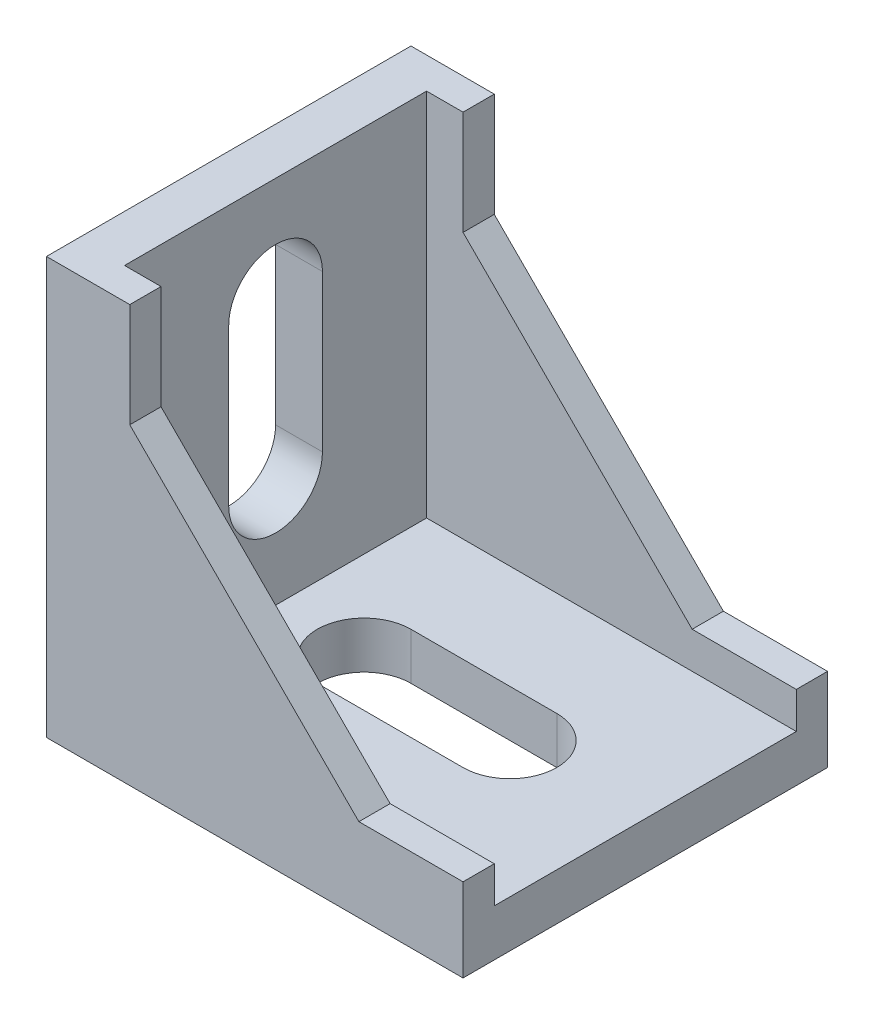
ISO-10303-21;
HEADER;
FILE_DESCRIPTION(('STEP AP214'),'2;1');
FILE_NAME('part.step','',(''),(''),'','','');
FILE_SCHEMA(('AUTOMOTIVE_DESIGN { 1 0 10303 214 1 1 1 1 }'));
ENDSEC;
DATA;
#1=APPLICATION_CONTEXT('core data for automotive mechanical design processes');
#2=APPLICATION_PROTOCOL_DEFINITION('international standard','automotive_design',2000,#1);
#3=PRODUCT_CONTEXT('',#1,'mechanical');
#4=PRODUCT('Part','Part','',(#3));
#5=PRODUCT_RELATED_PRODUCT_CATEGORY('part','',(#4));
#6=PRODUCT_DEFINITION_FORMATION('','',#4);
#7=PRODUCT_DEFINITION_CONTEXT('part definition',#1,'design');
#8=PRODUCT_DEFINITION('design','',#6,#7);
#9=PRODUCT_DEFINITION_SHAPE('','',#8);
#10=(LENGTH_UNIT() NAMED_UNIT(*) SI_UNIT(.MILLI.,.METRE.));
#11=(NAMED_UNIT(*) PLANE_ANGLE_UNIT() SI_UNIT($,.RADIAN.));
#12=(NAMED_UNIT(*) SI_UNIT($,.STERADIAN.) SOLID_ANGLE_UNIT());
#13=UNCERTAINTY_MEASURE_WITH_UNIT(LENGTH_MEASURE(1.E-05),#10,'distance_accuracy_value','');
#14=(GEOMETRIC_REPRESENTATION_CONTEXT(3) GLOBAL_UNCERTAINTY_ASSIGNED_CONTEXT((#13)) GLOBAL_UNIT_ASSIGNED_CONTEXT((#10,
#11,#12)) REPRESENTATION_CONTEXT('',''));
#15=CARTESIAN_POINT('',(0.,0.,0.));
#16=DIRECTION('',(0.,0.,1.));
#17=DIRECTION('',(1.,0.,0.));
#18=AXIS2_PLACEMENT_3D('',#15,#16,#17);
#19=CARTESIAN_POINT('',(0.,40.,-17.5));
#20=DIRECTION('',(0.,1.,0.));
#21=DIRECTION('',(0.,0.,1.));
#22=AXIS2_PLACEMENT_3D('',#19,#20,#21);
#23=PLANE('',#22);
#24=DIRECTION('',(0.,0.,1.));
#25=VECTOR('',#24,1.);
#26=CARTESIAN_POINT('',(4.5,40.,-14.5));
#27=LINE('',#26,#25);
#28=CARTESIAN_POINT('',(4.5,40.,-14.5));
#29=VERTEX_POINT('',#28);
#30=CARTESIAN_POINT('',(4.5,40.,14.5));
#31=VERTEX_POINT('',#30);
#32=EDGE_CURVE('E264',#29,#31,#27,.T.);
#33=ORIENTED_EDGE('',*,*,#32,.F.);
#34=DIRECTION('',(-1.,0.,0.));
#35=VECTOR('',#34,1.);
#36=CARTESIAN_POINT('',(8.,40.,-14.5));
#37=LINE('',#36,#35);
#38=CARTESIAN_POINT('',(8.,40.,-14.5));
#39=VERTEX_POINT('',#38);
#40=EDGE_CURVE('E252',#39,#29,#37,.T.);
#41=ORIENTED_EDGE('',*,*,#40,.F.);
#42=DIRECTION('',(0.,0.,1.));
#43=VECTOR('',#42,1.);
#44=CARTESIAN_POINT('',(8.,40.,-17.5));
#45=LINE('',#44,#43);
#46=CARTESIAN_POINT('',(8.,40.,-17.5));
#47=VERTEX_POINT('',#46);
#48=EDGE_CURVE('E11',#47,#39,#45,.T.);
#49=ORIENTED_EDGE('',*,*,#48,.F.);
#50=DIRECTION('',(-1.,0.,0.));
#51=VECTOR('',#50,1.);
#52=CARTESIAN_POINT('',(0.,40.,-17.5));
#53=LINE('',#52,#51);
#54=CARTESIAN_POINT('',(0.,40.,-17.5));
#55=VERTEX_POINT('',#54);
#56=EDGE_CURVE('E297',#47,#55,#53,.T.);
#57=ORIENTED_EDGE('',*,*,#56,.T.);
#58=DIRECTION('',(0.,0.,1.));
#59=VECTOR('',#58,1.);
#60=CARTESIAN_POINT('',(0.,40.,-17.5));
#61=LINE('',#60,#59);
#62=CARTESIAN_POINT('',(0.,40.,17.5));
#63=VERTEX_POINT('',#62);
#64=EDGE_CURVE('E37',#55,#63,#61,.T.);
#65=ORIENTED_EDGE('',*,*,#64,.T.);
#66=DIRECTION('',(-1.,0.,0.));
#67=VECTOR('',#66,1.);
#68=CARTESIAN_POINT('',(0.,40.,17.5));
#69=LINE('',#68,#67);
#70=CARTESIAN_POINT('',(8.,40.,17.5));
#71=VERTEX_POINT('',#70);
#72=EDGE_CURVE('E296',#71,#63,#69,.T.);
#73=ORIENTED_EDGE('',*,*,#72,.F.);
#74=CARTESIAN_POINT('',(8.,40.,14.5));
#75=VERTEX_POINT('',#74);
#76=EDGE_CURVE('E42',#75,#71,#45,.T.);
#77=ORIENTED_EDGE('',*,*,#76,.F.);
#78=DIRECTION('',(-1.,0.,0.));
#79=VECTOR('',#78,1.);
#80=CARTESIAN_POINT('',(8.,40.,14.5));
#81=LINE('',#80,#79);
#82=EDGE_CURVE('E251',#75,#31,#81,.T.);
#83=ORIENTED_EDGE('',*,*,#82,.T.);
#84=EDGE_LOOP('',(#33,#41,#49,#57,#65,#73,#77,#83));
#85=FACE_BOUND('',#84,.T.);
#86=ADVANCED_FACE('F34',(#85),#23,.T.);
#87=CARTESIAN_POINT('',(8.,40.,-17.5));
#88=DIRECTION('',(1.,0.,0.));
#89=DIRECTION('',(0.,1.,0.));
#90=AXIS2_PLACEMENT_3D('',#87,#88,#89);
#91=PLANE('',#90);
#92=ORIENTED_EDGE('',*,*,#48,.T.);
#93=DIRECTION('',(0.,-1.,0.));
#94=VECTOR('',#93,1.);
#95=CARTESIAN_POINT('',(8.,40.,-14.5));
#96=LINE('',#95,#94);
#97=CARTESIAN_POINT('',(8.,30.,-14.5));
#98=VERTEX_POINT('',#97);
#99=EDGE_CURVE('E293',#39,#98,#96,.T.);
#100=ORIENTED_EDGE('',*,*,#99,.T.);
#101=DIRECTION('',(0.,0.,1.));
#102=VECTOR('',#101,1.);
#103=CARTESIAN_POINT('',(8.,30.,-17.5));
#104=LINE('',#103,#102);
#105=CARTESIAN_POINT('',(8.,30.,-17.5));
#106=VERTEX_POINT('',#105);
#107=EDGE_CURVE('E338',#106,#98,#104,.T.);
#108=ORIENTED_EDGE('',*,*,#107,.F.);
#109=DIRECTION('',(0.,1.,0.));
#110=VECTOR('',#109,1.);
#111=CARTESIAN_POINT('',(8.,40.,-17.5));
#112=LINE('',#111,#110);
#113=EDGE_CURVE('E316',#106,#47,#112,.T.);
#114=ORIENTED_EDGE('',*,*,#113,.T.);
#115=EDGE_LOOP('',(#92,#100,#108,#114));
#116=FACE_BOUND('',#115,.T.);
#117=ADVANCED_FACE('F380',(#116),#91,.T.);
#118=CARTESIAN_POINT('',(8.,30.,-17.5));
#119=DIRECTION('',(0.707106781186548,0.707106781186548,0.));
#120=DIRECTION('',(-0.707106781186548,0.707106781186548,0.));
#121=AXIS2_PLACEMENT_3D('',#118,#119,#120);
#122=PLANE('',#121);
#123=ORIENTED_EDGE('',*,*,#107,.T.);
#124=DIRECTION('',(0.707106781186548,-0.707106781186548,0.));
#125=VECTOR('',#124,1.);
#126=CARTESIAN_POINT('',(8.,30.,-14.5));
#127=LINE('',#126,#125);
#128=CARTESIAN_POINT('',(30.,8.,-14.5));
#129=VERTEX_POINT('',#128);
#130=EDGE_CURVE('E290',#98,#129,#127,.T.);
#131=ORIENTED_EDGE('',*,*,#130,.T.);
#132=DIRECTION('',(0.,0.,1.));
#133=VECTOR('',#132,1.);
#134=CARTESIAN_POINT('',(30.,8.,-17.5));
#135=LINE('',#134,#133);
#136=CARTESIAN_POINT('',(30.,8.,-17.5));
#137=VERTEX_POINT('',#136);
#138=EDGE_CURVE('E342',#137,#129,#135,.T.);
#139=ORIENTED_EDGE('',*,*,#138,.F.);
#140=DIRECTION('',(-0.707106781186548,0.707106781186548,0.));
#141=VECTOR('',#140,1.);
#142=CARTESIAN_POINT('',(8.,30.,-17.5));
#143=LINE('',#142,#141);
#144=EDGE_CURVE('E313',#137,#106,#143,.T.);
#145=ORIENTED_EDGE('',*,*,#144,.T.);
#146=EDGE_LOOP('',(#123,#131,#139,#145));
#147=FACE_BOUND('',#146,.T.);
#148=ADVANCED_FACE('F407',(#147),#122,.T.);
#149=CARTESIAN_POINT('',(30.,8.,-17.5));
#150=DIRECTION('',(0.,1.,0.));
#151=DIRECTION('',(0.,0.,1.));
#152=AXIS2_PLACEMENT_3D('',#149,#150,#151);
#153=PLANE('',#152);
#154=ORIENTED_EDGE('',*,*,#138,.T.);
#155=DIRECTION('',(1.,0.,0.));
#156=VECTOR('',#155,1.);
#157=CARTESIAN_POINT('',(30.,8.,-14.5));
#158=LINE('',#157,#156);
#159=CARTESIAN_POINT('',(40.,8.,-14.5));
#160=VERTEX_POINT('',#159);
#161=EDGE_CURVE('E287',#129,#160,#158,.T.);
#162=ORIENTED_EDGE('',*,*,#161,.T.);
#163=DIRECTION('',(0.,0.,1.));
#164=VECTOR('',#163,1.);
#165=CARTESIAN_POINT('',(40.,8.,-17.5));
#166=LINE('',#165,#164);
#167=CARTESIAN_POINT('',(40.,8.,-17.5));
#168=VERTEX_POINT('',#167);
#169=EDGE_CURVE('E346',#168,#160,#166,.T.);
#170=ORIENTED_EDGE('',*,*,#169,.F.);
#171=DIRECTION('',(-1.,0.,0.));
#172=VECTOR('',#171,1.);
#173=CARTESIAN_POINT('',(30.,8.,-17.5));
#174=LINE('',#173,#172);
#175=EDGE_CURVE('E310',#168,#137,#174,.T.);
#176=ORIENTED_EDGE('',*,*,#175,.T.);
#177=EDGE_LOOP('',(#154,#162,#170,#176));
#178=FACE_BOUND('',#177,.T.);
#179=ADVANCED_FACE('F405',(#178),#153,.T.);
#180=CARTESIAN_POINT('',(40.,8.,-17.5));
#181=DIRECTION('',(1.,0.,0.));
#182=DIRECTION('',(0.,0.,-1.));
#183=AXIS2_PLACEMENT_3D('',#180,#181,#182);
#184=PLANE('',#183);
#185=ORIENTED_EDGE('',*,*,#169,.T.);
#186=DIRECTION('',(0.,1.,0.));
#187=VECTOR('',#186,1.);
#188=CARTESIAN_POINT('',(40.,4.5,-14.5));
#189=LINE('',#188,#187);
#190=CARTESIAN_POINT('',(40.,4.5,-14.5));
#191=VERTEX_POINT('',#190);
#192=EDGE_CURVE('E262',#191,#160,#189,.T.);
#193=ORIENTED_EDGE('',*,*,#192,.F.);
#194=DIRECTION('',(0.,0.,1.));
#195=VECTOR('',#194,1.);
#196=CARTESIAN_POINT('',(40.,4.5,-14.5));
#197=LINE('',#196,#195);
#198=CARTESIAN_POINT('',(40.,4.5,14.5));
#199=VERTEX_POINT('',#198);
#200=EDGE_CURVE('E275',#191,#199,#197,.T.);
#201=ORIENTED_EDGE('',*,*,#200,.T.);
#202=DIRECTION('',(0.,1.,0.));
#203=VECTOR('',#202,1.);
#204=CARTESIAN_POINT('',(40.,4.5,14.5));
#205=LINE('',#204,#203);
#206=CARTESIAN_POINT('',(40.,8.,14.5));
#207=VERTEX_POINT('',#206);
#208=EDGE_CURVE('E256',#199,#207,#205,.T.);
#209=ORIENTED_EDGE('',*,*,#208,.T.);
#210=CARTESIAN_POINT('',(40.,8.,17.5));
#211=VERTEX_POINT('',#210);
#212=EDGE_CURVE('E349',#207,#211,#166,.T.);
#213=ORIENTED_EDGE('',*,*,#212,.T.);
#214=DIRECTION('',(0.,1.,0.));
#215=VECTOR('',#214,1.);
#216=CARTESIAN_POINT('',(40.,8.,17.5));
#217=LINE('',#216,#215);
#218=CARTESIAN_POINT('',(40.,0.,17.5));
#219=VERTEX_POINT('',#218);
#220=EDGE_CURVE('E327',#219,#211,#217,.T.);
#221=ORIENTED_EDGE('',*,*,#220,.F.);
#222=DIRECTION('',(0.,0.,1.));
#223=VECTOR('',#222,1.);
#224=CARTESIAN_POINT('',(40.,0.,-17.5));
#225=LINE('',#224,#223);
#226=CARTESIAN_POINT('',(40.,0.,-17.5));
#227=VERTEX_POINT('',#226);
#228=EDGE_CURVE('E350',#227,#219,#225,.T.);
#229=ORIENTED_EDGE('',*,*,#228,.F.);
#230=DIRECTION('',(0.,1.,0.));
#231=VECTOR('',#230,1.);
#232=CARTESIAN_POINT('',(40.,8.,-17.5));
#233=LINE('',#232,#231);
#234=EDGE_CURVE('E307',#227,#168,#233,.T.);
#235=ORIENTED_EDGE('',*,*,#234,.T.);
#236=EDGE_LOOP('',(#185,#193,#201,#209,#213,#221,#229,#235));
#237=FACE_BOUND('',#236,.T.);
#238=ADVANCED_FACE('F393',(#237),#184,.T.);
#239=DIRECTION('',(0.,-1.,0.));
#240=VECTOR('',#239,1.);
#241=CARTESIAN_POINT('',(8.,40.,14.5));
#242=LINE('',#241,#240);
#243=CARTESIAN_POINT('',(8.,30.,14.5));
#244=VERTEX_POINT('',#243);
#245=EDGE_CURVE('E285',#75,#244,#242,.T.);
#246=ORIENTED_EDGE('',*,*,#245,.F.);
#247=ORIENTED_EDGE('',*,*,#76,.T.);
#248=DIRECTION('',(0.,1.,0.));
#249=VECTOR('',#248,1.);
#250=CARTESIAN_POINT('',(8.,40.,17.5));
#251=LINE('',#250,#249);
#252=CARTESIAN_POINT('',(8.,30.,17.5));
#253=VERTEX_POINT('',#252);
#254=EDGE_CURVE('E301',#253,#71,#251,.T.);
#255=ORIENTED_EDGE('',*,*,#254,.F.);
#256=EDGE_CURVE('E341',#244,#253,#104,.T.);
#257=ORIENTED_EDGE('',*,*,#256,.F.);
#258=EDGE_LOOP('',(#246,#247,#255,#257));
#259=FACE_BOUND('',#258,.T.);
#260=ADVANCED_FACE('F369',(#259),#91,.T.);
#261=DIRECTION('',(0.707106781186548,-0.707106781186548,0.));
#262=VECTOR('',#261,1.);
#263=CARTESIAN_POINT('',(8.,30.,14.5));
#264=LINE('',#263,#262);
#265=CARTESIAN_POINT('',(30.,8.,14.5));
#266=VERTEX_POINT('',#265);
#267=EDGE_CURVE('E283',#244,#266,#264,.T.);
#268=ORIENTED_EDGE('',*,*,#267,.F.);
#269=ORIENTED_EDGE('',*,*,#256,.T.);
#270=DIRECTION('',(-0.707106781186548,0.707106781186548,0.));
#271=VECTOR('',#270,1.);
#272=CARTESIAN_POINT('',(8.,30.,17.5));
#273=LINE('',#272,#271);
#274=CARTESIAN_POINT('',(30.,8.,17.5));
#275=VERTEX_POINT('',#274);
#276=EDGE_CURVE('E333',#275,#253,#273,.T.);
#277=ORIENTED_EDGE('',*,*,#276,.F.);
#278=EDGE_CURVE('E345',#266,#275,#135,.T.);
#279=ORIENTED_EDGE('',*,*,#278,.F.);
#280=EDGE_LOOP('',(#268,#269,#277,#279));
#281=FACE_BOUND('',#280,.T.);
#282=ADVANCED_FACE('F400',(#281),#122,.T.);
#283=DIRECTION('',(1.,0.,0.));
#284=VECTOR('',#283,1.);
#285=CARTESIAN_POINT('',(30.,8.,14.5));
#286=LINE('',#285,#284);
#287=EDGE_CURVE('E278',#266,#207,#286,.T.);
#288=ORIENTED_EDGE('',*,*,#287,.F.);
#289=ORIENTED_EDGE('',*,*,#278,.T.);
#290=DIRECTION('',(-1.,0.,0.));
#291=VECTOR('',#290,1.);
#292=CARTESIAN_POINT('',(30.,8.,17.5));
#293=LINE('',#292,#291);
#294=EDGE_CURVE('E330',#211,#275,#293,.T.);
#295=ORIENTED_EDGE('',*,*,#294,.F.);
#296=ORIENTED_EDGE('',*,*,#212,.F.);
#297=EDGE_LOOP('',(#288,#289,#295,#296));
#298=FACE_BOUND('',#297,.T.);
#299=ADVANCED_FACE('F397',(#298),#153,.T.);
#300=CARTESIAN_POINT('',(0.,0.,-17.5));
#301=DIRECTION('',(0.,-1.,0.));
#302=DIRECTION('',(0.,0.,-1.));
#303=AXIS2_PLACEMENT_3D('',#300,#301,#302);
#304=PLANE('',#303);
#305=CARTESIAN_POINT('',(13.,0.,0.));
#306=DIRECTION('',(0.,-1.,0.));
#307=DIRECTION('',(0.,0.,1.));
#308=AXIS2_PLACEMENT_3D('',#305,#306,#307);
#309=CIRCLE('',#308,4.5);
#310=CARTESIAN_POINT('',(13.,0.,4.5));
#311=VERTEX_POINT('',#310);
#312=CARTESIAN_POINT('',(13.,0.,-4.5));
#313=VERTEX_POINT('',#312);
#314=EDGE_CURVE('E228',#311,#313,#309,.T.);
#315=ORIENTED_EDGE('',*,*,#314,.F.);
#316=DIRECTION('',(-1.,0.,0.));
#317=VECTOR('',#316,1.);
#318=CARTESIAN_POINT('',(13.,0.,4.5));
#319=LINE('',#318,#317);
#320=CARTESIAN_POINT('',(27.,0.,4.5));
#321=VERTEX_POINT('',#320);
#322=EDGE_CURVE('E236',#321,#311,#319,.T.);
#323=ORIENTED_EDGE('',*,*,#322,.F.);
#324=CARTESIAN_POINT('',(27.,0.,0.));
#325=DIRECTION('',(0.,-1.,0.));
#326=DIRECTION('',(0.,0.,-1.));
#327=AXIS2_PLACEMENT_3D('',#324,#325,#326);
#328=CIRCLE('',#327,4.5);
#329=CARTESIAN_POINT('',(27.,0.,-4.5));
#330=VERTEX_POINT('',#329);
#331=EDGE_CURVE('E233',#330,#321,#328,.T.);
#332=ORIENTED_EDGE('',*,*,#331,.F.);
#333=DIRECTION('',(1.,0.,0.));
#334=VECTOR('',#333,1.);
#335=CARTESIAN_POINT('',(13.,0.,-4.5));
#336=LINE('',#335,#334);
#337=EDGE_CURVE('E230',#313,#330,#336,.T.);
#338=ORIENTED_EDGE('',*,*,#337,.F.);
#339=EDGE_LOOP('',(#315,#323,#332,#338));
#340=FACE_BOUND('',#339,.T.);
#341=DIRECTION('',(1.,0.,0.));
#342=VECTOR('',#341,1.);
#343=CARTESIAN_POINT('',(0.,0.,17.5));
#344=LINE('',#343,#342);
#345=CARTESIAN_POINT('',(0.,0.,17.5));
#346=VERTEX_POINT('',#345);
#347=EDGE_CURVE('E324',#346,#219,#344,.T.);
#348=ORIENTED_EDGE('',*,*,#347,.F.);
#349=DIRECTION('',(0.,0.,1.));
#350=VECTOR('',#349,1.);
#351=CARTESIAN_POINT('',(0.,0.,-17.5));
#352=LINE('',#351,#350);
#353=CARTESIAN_POINT('',(0.,0.,-17.5));
#354=VERTEX_POINT('',#353);
#355=EDGE_CURVE('E351',#354,#346,#352,.T.);
#356=ORIENTED_EDGE('',*,*,#355,.F.);
#357=DIRECTION('',(1.,0.,0.));
#358=VECTOR('',#357,1.);
#359=CARTESIAN_POINT('',(0.,0.,-17.5));
#360=LINE('',#359,#358);
#361=EDGE_CURVE('E304',#354,#227,#360,.T.);
#362=ORIENTED_EDGE('',*,*,#361,.T.);
#363=ORIENTED_EDGE('',*,*,#228,.T.);
#364=EDGE_LOOP('',(#348,#356,#362,#363));
#365=FACE_BOUND('',#364,.T.);
#366=ADVANCED_FACE('F389',(#340,#365),#304,.T.);
#367=CARTESIAN_POINT('',(0.,40.,-17.5));
#368=DIRECTION('',(-1.,0.,0.));
#369=DIRECTION('',(0.,-1.,0.));
#370=AXIS2_PLACEMENT_3D('',#367,#368,#369);
#371=PLANE('',#370);
#372=CARTESIAN_POINT('',(0.,15.,0.));
#373=DIRECTION('',(-1.,0.,0.));
#374=DIRECTION('',(0.,1.,0.));
#375=AXIS2_PLACEMENT_3D('',#372,#373,#374);
#376=CIRCLE('',#375,4.5);
#377=CARTESIAN_POINT('',(0.,15.,-4.5));
#378=VERTEX_POINT('',#377);
#379=CARTESIAN_POINT('',(0.,15.,4.5));
#380=VERTEX_POINT('',#379);
#381=EDGE_CURVE('E50',#378,#380,#376,.T.);
#382=ORIENTED_EDGE('',*,*,#381,.F.);
#383=DIRECTION('',(0.,-1.,0.));
#384=VECTOR('',#383,1.);
#385=CARTESIAN_POINT('',(0.,15.,-4.5));
#386=LINE('',#385,#384);
#387=CARTESIAN_POINT('',(0.,30.,-4.5));
#388=VERTEX_POINT('',#387);
#389=EDGE_CURVE('E192',#388,#378,#386,.T.);
#390=ORIENTED_EDGE('',*,*,#389,.F.);
#391=CARTESIAN_POINT('',(0.,30.,0.));
#392=DIRECTION('',(-1.,0.,0.));
#393=DIRECTION('',(0.,-1.,0.));
#394=AXIS2_PLACEMENT_3D('',#391,#392,#393);
#395=CIRCLE('',#394,4.5);
#396=CARTESIAN_POINT('',(0.,30.,4.5));
#397=VERTEX_POINT('',#396);
#398=EDGE_CURVE('E212',#397,#388,#395,.T.);
#399=ORIENTED_EDGE('',*,*,#398,.F.);
#400=DIRECTION('',(0.,1.,0.));
#401=VECTOR('',#400,1.);
#402=CARTESIAN_POINT('',(0.,15.,4.5));
#403=LINE('',#402,#401);
#404=EDGE_CURVE('E206',#380,#397,#403,.T.);
#405=ORIENTED_EDGE('',*,*,#404,.F.);
#406=EDGE_LOOP('',(#382,#390,#399,#405));
#407=FACE_BOUND('',#406,.T.);
#408=DIRECTION('',(0.,-1.,0.));
#409=VECTOR('',#408,1.);
#410=CARTESIAN_POINT('',(0.,40.,17.5));
#411=LINE('',#410,#409);
#412=EDGE_CURVE('E321',#63,#346,#411,.T.);
#413=ORIENTED_EDGE('',*,*,#412,.F.);
#414=ORIENTED_EDGE('',*,*,#64,.F.);
#415=DIRECTION('',(0.,-1.,0.));
#416=VECTOR('',#415,1.);
#417=CARTESIAN_POINT('',(0.,40.,-17.5));
#418=LINE('',#417,#416);
#419=EDGE_CURVE('E300',#55,#354,#418,.T.);
#420=ORIENTED_EDGE('',*,*,#419,.T.);
#421=ORIENTED_EDGE('',*,*,#355,.T.);
#422=EDGE_LOOP('',(#413,#414,#420,#421));
#423=FACE_BOUND('',#422,.T.);
#424=ADVANCED_FACE('F361',(#407,#423),#371,.T.);
#425=CARTESIAN_POINT('',(8.,40.,-17.5));
#426=DIRECTION('',(0.,0.,-1.));
#427=DIRECTION('',(-1.,0.,0.));
#428=AXIS2_PLACEMENT_3D('',#425,#426,#427);
#429=PLANE('',#428);
#430=ORIENTED_EDGE('',*,*,#56,.F.);
#431=ORIENTED_EDGE('',*,*,#113,.F.);
#432=ORIENTED_EDGE('',*,*,#144,.F.);
#433=ORIENTED_EDGE('',*,*,#175,.F.);
#434=ORIENTED_EDGE('',*,*,#234,.F.);
#435=ORIENTED_EDGE('',*,*,#361,.F.);
#436=ORIENTED_EDGE('',*,*,#419,.F.);
#437=EDGE_LOOP('',(#430,#431,#432,#433,#434,#435,#436));
#438=FACE_BOUND('',#437,.T.);
#439=ADVANCED_FACE('F384',(#438),#429,.T.);
#440=CARTESIAN_POINT('',(8.,40.,17.5));
#441=DIRECTION('',(0.,0.,-1.));
#442=DIRECTION('',(-1.,0.,0.));
#443=AXIS2_PLACEMENT_3D('',#440,#441,#442);
#444=PLANE('',#443);
#445=ORIENTED_EDGE('',*,*,#72,.T.);
#446=ORIENTED_EDGE('',*,*,#412,.T.);
#447=ORIENTED_EDGE('',*,*,#347,.T.);
#448=ORIENTED_EDGE('',*,*,#220,.T.);
#449=ORIENTED_EDGE('',*,*,#294,.T.);
#450=ORIENTED_EDGE('',*,*,#276,.T.);
#451=ORIENTED_EDGE('',*,*,#254,.T.);
#452=EDGE_LOOP('',(#445,#446,#447,#448,#449,#450,#451));
#453=FACE_BOUND('',#452,.T.);
#454=ADVANCED_FACE('F363',(#453),#444,.F.);
#455=CARTESIAN_POINT('',(4.5,4.5,-14.5));
#456=DIRECTION('',(0.,-1.,0.));
#457=DIRECTION('',(0.,0.,-1.));
#458=AXIS2_PLACEMENT_3D('',#455,#456,#457);
#459=PLANE('',#458);
#460=DIRECTION('',(1.,0.,0.));
#461=VECTOR('',#460,1.);
#462=CARTESIAN_POINT('',(13.,4.5,4.5));
#463=LINE('',#462,#461);
#464=CARTESIAN_POINT('',(13.,4.5,4.5));
#465=VERTEX_POINT('',#464);
#466=CARTESIAN_POINT('',(27.,4.5,4.5));
#467=VERTEX_POINT('',#466);
#468=EDGE_CURVE('E222',#465,#467,#463,.T.);
#469=ORIENTED_EDGE('',*,*,#468,.F.);
#470=CARTESIAN_POINT('',(13.,4.5,0.));
#471=DIRECTION('',(0.,-1.,0.));
#472=DIRECTION('',(0.,0.,-1.));
#473=AXIS2_PLACEMENT_3D('',#470,#471,#472);
#474=CIRCLE('',#473,4.5);
#475=CARTESIAN_POINT('',(13.,4.5,-4.5));
#476=VERTEX_POINT('',#475);
#477=EDGE_CURVE('E225',#476,#465,#474,.F.);
#478=ORIENTED_EDGE('',*,*,#477,.F.);
#479=DIRECTION('',(-1.,0.,0.));
#480=VECTOR('',#479,1.);
#481=CARTESIAN_POINT('',(13.,4.5,-4.5));
#482=LINE('',#481,#480);
#483=CARTESIAN_POINT('',(27.,4.5,-4.5));
#484=VERTEX_POINT('',#483);
#485=EDGE_CURVE('E242',#484,#476,#482,.T.);
#486=ORIENTED_EDGE('',*,*,#485,.F.);
#487=CARTESIAN_POINT('',(27.,4.5,0.));
#488=DIRECTION('',(0.,-1.,0.));
#489=DIRECTION('',(0.,0.,-1.));
#490=AXIS2_PLACEMENT_3D('',#487,#488,#489);
#491=CIRCLE('',#490,4.5);
#492=EDGE_CURVE('E198',#467,#484,#491,.F.);
#493=ORIENTED_EDGE('',*,*,#492,.F.);
#494=EDGE_LOOP('',(#469,#478,#486,#493));
#495=FACE_BOUND('',#494,.T.);
#496=DIRECTION('',(1.,0.,0.));
#497=VECTOR('',#496,1.);
#498=CARTESIAN_POINT('',(4.5,4.5,14.5));
#499=LINE('',#498,#497);
#500=CARTESIAN_POINT('',(4.5,4.5,14.5));
#501=VERTEX_POINT('',#500);
#502=EDGE_CURVE('E270',#501,#199,#499,.T.);
#503=ORIENTED_EDGE('',*,*,#502,.T.);
#504=ORIENTED_EDGE('',*,*,#200,.F.);
#505=DIRECTION('',(1.,0.,0.));
#506=VECTOR('',#505,1.);
#507=CARTESIAN_POINT('',(4.5,4.5,-14.5));
#508=LINE('',#507,#506);
#509=CARTESIAN_POINT('',(4.5,4.5,-14.5));
#510=VERTEX_POINT('',#509);
#511=EDGE_CURVE('E259',#510,#191,#508,.T.);
#512=ORIENTED_EDGE('',*,*,#511,.F.);
#513=DIRECTION('',(0.,0.,1.));
#514=VECTOR('',#513,1.);
#515=CARTESIAN_POINT('',(4.5,4.5,-14.5));
#516=LINE('',#515,#514);
#517=EDGE_CURVE('E279',#510,#501,#516,.T.);
#518=ORIENTED_EDGE('',*,*,#517,.T.);
#519=EDGE_LOOP('',(#503,#504,#512,#518));
#520=FACE_BOUND('',#519,.T.);
#521=ADVANCED_FACE('F402',(#495,#520),#459,.F.);
#522=CARTESIAN_POINT('',(4.5,40.,-14.5));
#523=DIRECTION('',(-1.,0.,0.));
#524=DIRECTION('',(0.,-1.,0.));
#525=AXIS2_PLACEMENT_3D('',#522,#523,#524);
#526=PLANE('',#525);
#527=DIRECTION('',(0.,1.,0.));
#528=VECTOR('',#527,1.);
#529=CARTESIAN_POINT('',(4.5,15.,-4.5));
#530=LINE('',#529,#528);
#531=CARTESIAN_POINT('',(4.5,15.,-4.5));
#532=VERTEX_POINT('',#531);
#533=CARTESIAN_POINT('',(4.5,30.,-4.5));
#534=VERTEX_POINT('',#533);
#535=EDGE_CURVE('E204',#532,#534,#530,.T.);
#536=ORIENTED_EDGE('',*,*,#535,.F.);
#537=CARTESIAN_POINT('',(4.5,15.,0.));
#538=DIRECTION('',(-1.,0.,0.));
#539=DIRECTION('',(0.,-1.,0.));
#540=AXIS2_PLACEMENT_3D('',#537,#538,#539);
#541=CIRCLE('',#540,4.5);
#542=CARTESIAN_POINT('',(4.5,15.,4.5));
#543=VERTEX_POINT('',#542);
#544=EDGE_CURVE('E186',#543,#532,#541,.F.);
#545=ORIENTED_EDGE('',*,*,#544,.F.);
#546=DIRECTION('',(0.,-1.,0.));
#547=VECTOR('',#546,1.);
#548=CARTESIAN_POINT('',(4.5,15.,4.5));
#549=LINE('',#548,#547);
#550=CARTESIAN_POINT('',(4.5,30.,4.5));
#551=VERTEX_POINT('',#550);
#552=EDGE_CURVE('E195',#551,#543,#549,.T.);
#553=ORIENTED_EDGE('',*,*,#552,.F.);
#554=CARTESIAN_POINT('',(4.5,30.,0.));
#555=DIRECTION('',(-1.,0.,0.));
#556=DIRECTION('',(0.,-1.,0.));
#557=AXIS2_PLACEMENT_3D('',#554,#555,#556);
#558=CIRCLE('',#557,4.5);
#559=EDGE_CURVE('E58',#534,#551,#558,.F.);
#560=ORIENTED_EDGE('',*,*,#559,.F.);
#561=EDGE_LOOP('',(#536,#545,#553,#560));
#562=FACE_BOUND('',#561,.T.);
#563=DIRECTION('',(0.,-1.,0.));
#564=VECTOR('',#563,1.);
#565=CARTESIAN_POINT('',(4.5,40.,14.5));
#566=LINE('',#565,#564);
#567=EDGE_CURVE('E267',#31,#501,#566,.T.);
#568=ORIENTED_EDGE('',*,*,#567,.T.);
#569=ORIENTED_EDGE('',*,*,#517,.F.);
#570=DIRECTION('',(0.,-1.,0.));
#571=VECTOR('',#570,1.);
#572=CARTESIAN_POINT('',(4.5,40.,-14.5));
#573=LINE('',#572,#571);
#574=EDGE_CURVE('E255',#29,#510,#573,.T.);
#575=ORIENTED_EDGE('',*,*,#574,.F.);
#576=ORIENTED_EDGE('',*,*,#32,.T.);
#577=EDGE_LOOP('',(#568,#569,#575,#576));
#578=FACE_BOUND('',#577,.T.);
#579=ADVANCED_FACE('F201',(#562,#578),#526,.F.);
#580=CARTESIAN_POINT('',(4.5,40.,-14.5));
#581=DIRECTION('',(0.,0.,1.));
#582=DIRECTION('',(1.,0.,0.));
#583=AXIS2_PLACEMENT_3D('',#580,#581,#582);
#584=PLANE('',#583);
#585=ORIENTED_EDGE('',*,*,#40,.T.);
#586=ORIENTED_EDGE('',*,*,#574,.T.);
#587=ORIENTED_EDGE('',*,*,#511,.T.);
#588=ORIENTED_EDGE('',*,*,#192,.T.);
#589=ORIENTED_EDGE('',*,*,#161,.F.);
#590=ORIENTED_EDGE('',*,*,#130,.F.);
#591=ORIENTED_EDGE('',*,*,#99,.F.);
#592=EDGE_LOOP('',(#585,#586,#587,#588,#589,#590,#591));
#593=FACE_BOUND('',#592,.T.);
#594=ADVANCED_FACE('F378',(#593),#584,.T.);
#595=CARTESIAN_POINT('',(4.5,40.,14.5));
#596=DIRECTION('',(0.,0.,1.));
#597=DIRECTION('',(1.,0.,0.));
#598=AXIS2_PLACEMENT_3D('',#595,#596,#597);
#599=PLANE('',#598);
#600=ORIENTED_EDGE('',*,*,#245,.T.);
#601=ORIENTED_EDGE('',*,*,#267,.T.);
#602=ORIENTED_EDGE('',*,*,#287,.T.);
#603=ORIENTED_EDGE('',*,*,#208,.F.);
#604=ORIENTED_EDGE('',*,*,#502,.F.);
#605=ORIENTED_EDGE('',*,*,#567,.F.);
#606=ORIENTED_EDGE('',*,*,#82,.F.);
#607=EDGE_LOOP('',(#600,#601,#602,#603,#604,#605,#606));
#608=FACE_BOUND('',#607,.T.);
#609=ADVANCED_FACE('F373',(#608),#599,.F.);
#610=CARTESIAN_POINT('',(13.,40.001,0.));
#611=DIRECTION('',(0.,-1.,0.));
#612=DIRECTION('',(0.,0.,-1.));
#613=AXIS2_PLACEMENT_3D('',#610,#611,#612);
#614=CYLINDRICAL_SURFACE('',#613,4.5);
#615=ORIENTED_EDGE('',*,*,#477,.T.);
#616=DIRECTION('',(0.,-1.,0.));
#617=VECTOR('',#616,1.);
#618=CARTESIAN_POINT('',(13.,40.001,4.5));
#619=LINE('',#618,#617);
#620=EDGE_CURVE('E240',#465,#311,#619,.T.);
#621=ORIENTED_EDGE('',*,*,#620,.T.);
#622=ORIENTED_EDGE('',*,*,#314,.T.);
#623=DIRECTION('',(0.,-1.,0.));
#624=VECTOR('',#623,1.);
#625=CARTESIAN_POINT('',(13.,40.001,-4.5));
#626=LINE('',#625,#624);
#627=EDGE_CURVE('E239',#476,#313,#626,.T.);
#628=ORIENTED_EDGE('',*,*,#627,.F.);
#629=EDGE_LOOP('',(#615,#621,#622,#628));
#630=FACE_BOUND('',#629,.T.);
#631=ADVANCED_FACE('F485',(#630),#614,.F.);
#632=CARTESIAN_POINT('',(13.,40.001,4.5));
#633=DIRECTION('',(0.,0.,1.));
#634=DIRECTION('',(1.,0.,0.));
#635=AXIS2_PLACEMENT_3D('',#632,#633,#634);
#636=PLANE('',#635);
#637=ORIENTED_EDGE('',*,*,#468,.T.);
#638=DIRECTION('',(0.,-1.,0.));
#639=VECTOR('',#638,1.);
#640=CARTESIAN_POINT('',(27.,40.001,4.5));
#641=LINE('',#640,#639);
#642=EDGE_CURVE('E243',#467,#321,#641,.T.);
#643=ORIENTED_EDGE('',*,*,#642,.T.);
#644=ORIENTED_EDGE('',*,*,#322,.T.);
#645=ORIENTED_EDGE('',*,*,#620,.F.);
#646=EDGE_LOOP('',(#637,#643,#644,#645));
#647=FACE_BOUND('',#646,.T.);
#648=ADVANCED_FACE('F513',(#647),#636,.F.);
#649=CARTESIAN_POINT('',(27.,40.001,0.));
#650=DIRECTION('',(0.,-1.,0.));
#651=DIRECTION('',(0.,0.,-1.));
#652=AXIS2_PLACEMENT_3D('',#649,#650,#651);
#653=CYLINDRICAL_SURFACE('',#652,4.5);
#654=ORIENTED_EDGE('',*,*,#492,.T.);
#655=DIRECTION('',(0.,-1.,0.));
#656=VECTOR('',#655,1.);
#657=CARTESIAN_POINT('',(27.,40.001,-4.5));
#658=LINE('',#657,#656);
#659=EDGE_CURVE('E245',#484,#330,#658,.T.);
#660=ORIENTED_EDGE('',*,*,#659,.T.);
#661=ORIENTED_EDGE('',*,*,#331,.T.);
#662=ORIENTED_EDGE('',*,*,#642,.F.);
#663=EDGE_LOOP('',(#654,#660,#661,#662));
#664=FACE_BOUND('',#663,.T.);
#665=ADVANCED_FACE('F523',(#664),#653,.F.);
#666=CARTESIAN_POINT('',(13.,40.001,-4.5));
#667=DIRECTION('',(0.,0.,-1.));
#668=DIRECTION('',(-1.,0.,0.));
#669=AXIS2_PLACEMENT_3D('',#666,#667,#668);
#670=PLANE('',#669);
#671=ORIENTED_EDGE('',*,*,#485,.T.);
#672=ORIENTED_EDGE('',*,*,#627,.T.);
#673=ORIENTED_EDGE('',*,*,#337,.T.);
#674=ORIENTED_EDGE('',*,*,#659,.F.);
#675=EDGE_LOOP('',(#671,#672,#673,#674));
#676=FACE_BOUND('',#675,.T.);
#677=ADVANCED_FACE('F533',(#676),#670,.F.);
#678=CARTESIAN_POINT('',(40.001,15.,0.));
#679=DIRECTION('',(-1.,0.,0.));
#680=DIRECTION('',(0.,-1.,0.));
#681=AXIS2_PLACEMENT_3D('',#678,#679,#680);
#682=CYLINDRICAL_SURFACE('',#681,4.5);
#683=ORIENTED_EDGE('',*,*,#544,.T.);
#684=DIRECTION('',(-1.,0.,0.));
#685=VECTOR('',#684,1.);
#686=CARTESIAN_POINT('',(40.001,15.,-4.5));
#687=LINE('',#686,#685);
#688=EDGE_CURVE('E199',#532,#378,#687,.T.);
#689=ORIENTED_EDGE('',*,*,#688,.T.);
#690=ORIENTED_EDGE('',*,*,#381,.T.);
#691=DIRECTION('',(-1.,0.,0.));
#692=VECTOR('',#691,1.);
#693=CARTESIAN_POINT('',(40.001,15.,4.5));
#694=LINE('',#693,#692);
#695=EDGE_CURVE('E182',#543,#380,#694,.T.);
#696=ORIENTED_EDGE('',*,*,#695,.F.);
#697=EDGE_LOOP('',(#683,#689,#690,#696));
#698=FACE_BOUND('',#697,.T.);
#699=ADVANCED_FACE('F184',(#698),#682,.F.);
#700=CARTESIAN_POINT('',(40.001,15.,-4.5));
#701=DIRECTION('',(0.,0.,-1.));
#702=DIRECTION('',(-1.,0.,0.));
#703=AXIS2_PLACEMENT_3D('',#700,#701,#702);
#704=PLANE('',#703);
#705=ORIENTED_EDGE('',*,*,#535,.T.);
#706=DIRECTION('',(-1.,0.,0.));
#707=VECTOR('',#706,1.);
#708=CARTESIAN_POINT('',(40.001,30.,-4.5));
#709=LINE('',#708,#707);
#710=EDGE_CURVE('E218',#534,#388,#709,.T.);
#711=ORIENTED_EDGE('',*,*,#710,.T.);
#712=ORIENTED_EDGE('',*,*,#389,.T.);
#713=ORIENTED_EDGE('',*,*,#688,.F.);
#714=EDGE_LOOP('',(#705,#711,#712,#713));
#715=FACE_BOUND('',#714,.T.);
#716=ADVANCED_FACE('F566',(#715),#704,.F.);
#717=CARTESIAN_POINT('',(40.001,30.,0.));
#718=DIRECTION('',(-1.,0.,0.));
#719=DIRECTION('',(0.,-1.,0.));
#720=AXIS2_PLACEMENT_3D('',#717,#718,#719);
#721=CYLINDRICAL_SURFACE('',#720,4.5);
#722=ORIENTED_EDGE('',*,*,#559,.T.);
#723=DIRECTION('',(-1.,0.,0.));
#724=VECTOR('',#723,1.);
#725=CARTESIAN_POINT('',(40.001,30.,4.5));
#726=LINE('',#725,#724);
#727=EDGE_CURVE('E191',#551,#397,#726,.T.);
#728=ORIENTED_EDGE('',*,*,#727,.T.);
#729=ORIENTED_EDGE('',*,*,#398,.T.);
#730=ORIENTED_EDGE('',*,*,#710,.F.);
#731=EDGE_LOOP('',(#722,#728,#729,#730));
#732=FACE_BOUND('',#731,.T.);
#733=ADVANCED_FACE('F575',(#732),#721,.F.);
#734=CARTESIAN_POINT('',(40.001,15.,4.5));
#735=DIRECTION('',(0.,0.,1.));
#736=DIRECTION('',(1.,0.,0.));
#737=AXIS2_PLACEMENT_3D('',#734,#735,#736);
#738=PLANE('',#737);
#739=ORIENTED_EDGE('',*,*,#552,.T.);
#740=ORIENTED_EDGE('',*,*,#695,.T.);
#741=ORIENTED_EDGE('',*,*,#404,.T.);
#742=ORIENTED_EDGE('',*,*,#727,.F.);
#743=EDGE_LOOP('',(#739,#740,#741,#742));
#744=FACE_BOUND('',#743,.T.);
#745=ADVANCED_FACE('F196',(#744),#738,.F.);
#746=CLOSED_SHELL('',(#86,#117,#148,#179,#238,#260,#282,#299,#366,#424,#439,#454,#521,#579,#594,
#609,#631,#648,#665,#677,#699,#716,#733,#745));
#747=MANIFOLD_SOLID_BREP('B2',#746);
#748=ADVANCED_BREP_SHAPE_REPRESENTATION('',(#18,#747),#14);
#749=SHAPE_DEFINITION_REPRESENTATION(#9,#748);
ENDSEC;
END-ISO-10303-21;
